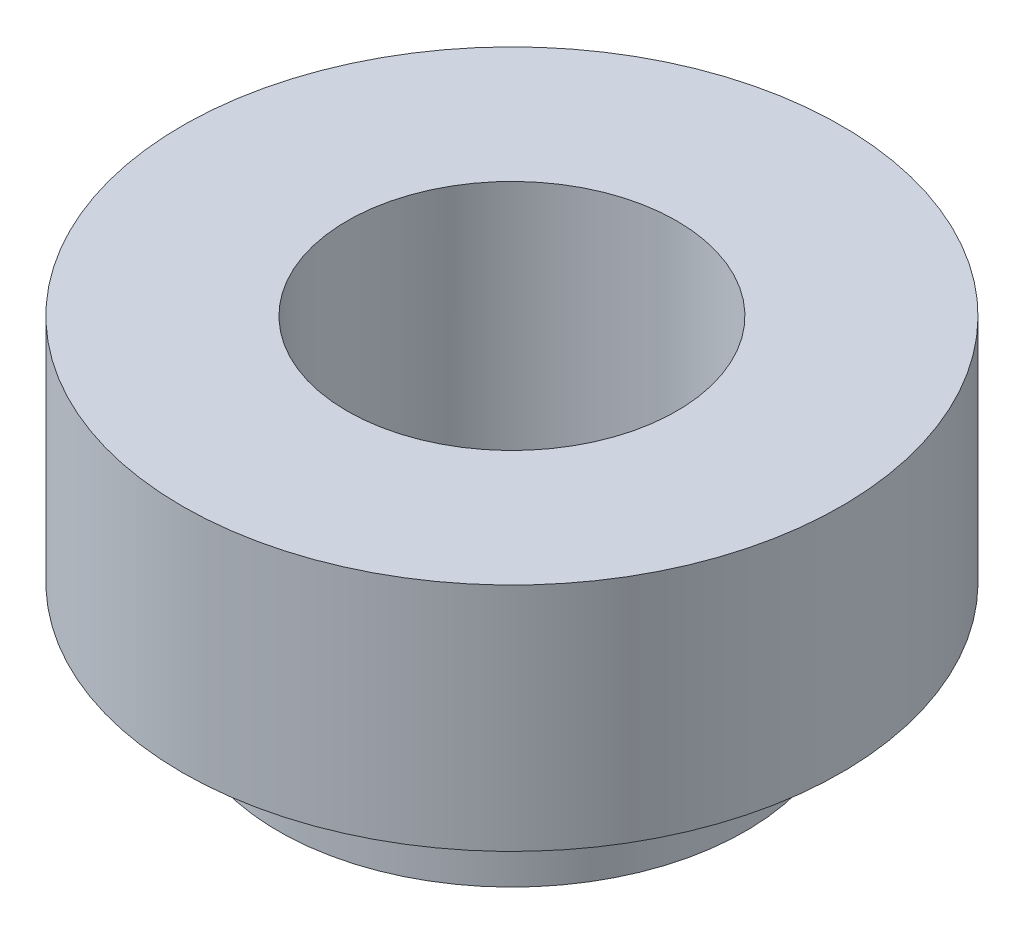
ISO-10303-21;
HEADER;
FILE_DESCRIPTION(('STEP AP214'),'2;1');
FILE_NAME('part.step','',(''),(''),'','','');
FILE_SCHEMA(('AUTOMOTIVE_DESIGN { 1 0 10303 214 1 1 1 1 }'));
ENDSEC;
DATA;
#1=APPLICATION_CONTEXT('core data for automotive mechanical design processes');
#2=APPLICATION_PROTOCOL_DEFINITION('international standard','automotive_design',2000,#1);
#3=PRODUCT_CONTEXT('',#1,'mechanical');
#4=PRODUCT('Part','Part','',(#3));
#5=PRODUCT_RELATED_PRODUCT_CATEGORY('part','',(#4));
#6=PRODUCT_DEFINITION_FORMATION('','',#4);
#7=PRODUCT_DEFINITION_CONTEXT('part definition',#1,'design');
#8=PRODUCT_DEFINITION('design','',#6,#7);
#9=PRODUCT_DEFINITION_SHAPE('','',#8);
#10=(LENGTH_UNIT() NAMED_UNIT(*) SI_UNIT(.MILLI.,.METRE.));
#11=(NAMED_UNIT(*) PLANE_ANGLE_UNIT() SI_UNIT($,.RADIAN.));
#12=(NAMED_UNIT(*) SI_UNIT($,.STERADIAN.) SOLID_ANGLE_UNIT());
#13=UNCERTAINTY_MEASURE_WITH_UNIT(LENGTH_MEASURE(1.E-05),#10,'distance_accuracy_value','');
#14=(GEOMETRIC_REPRESENTATION_CONTEXT(3) GLOBAL_UNCERTAINTY_ASSIGNED_CONTEXT((#13)) GLOBAL_UNIT_ASSIGNED_CONTEXT((#10,
#11,#12)) REPRESENTATION_CONTEXT('',''));
#15=CARTESIAN_POINT('',(0.,0.,0.));
#16=DIRECTION('',(0.,0.,1.));
#17=DIRECTION('',(1.,0.,0.));
#18=AXIS2_PLACEMENT_3D('',#15,#16,#17);
#19=CARTESIAN_POINT('',(0.,2.1,0.));
#20=DIRECTION('',(0.,-1.,0.));
#21=DIRECTION('',(0.,0.,-1.));
#22=AXIS2_PLACEMENT_3D('',#19,#20,#21);
#23=CYLINDRICAL_SURFACE('',#22,3.);
#24=CARTESIAN_POINT('',(0.,2.1,0.));
#25=DIRECTION('',(0.,1.,0.));
#26=DIRECTION('',(0.,0.,1.));
#27=AXIS2_PLACEMENT_3D('',#24,#25,#26);
#28=CIRCLE('',#27,3.);
#29=CARTESIAN_POINT('',(0.,2.1,3.));
#30=VERTEX_POINT('',#29);
#31=EDGE_CURVE('E46',#30,#30,#28,.T.);
#32=ORIENTED_EDGE('',*,*,#31,.F.);
#33=EDGE_LOOP('',(#32));
#34=FACE_BOUND('',#33,.T.);
#35=CARTESIAN_POINT('',(0.,0.,0.));
#36=DIRECTION('',(0.,1.,0.));
#37=DIRECTION('',(0.,0.,1.));
#38=AXIS2_PLACEMENT_3D('',#35,#36,#37);
#39=CIRCLE('',#38,3.);
#40=CARTESIAN_POINT('',(0.,0.,3.));
#41=VERTEX_POINT('',#40);
#42=EDGE_CURVE('E42',#41,#41,#39,.T.);
#43=ORIENTED_EDGE('',*,*,#42,.T.);
#44=EDGE_LOOP('',(#43));
#45=FACE_BOUND('',#44,.T.);
#46=ADVANCED_FACE('F39',(#34,#45),#23,.T.);
#47=CARTESIAN_POINT('',(0.,2.1,0.));
#48=DIRECTION('',(0.,1.,0.));
#49=DIRECTION('',(0.,0.,1.));
#50=AXIS2_PLACEMENT_3D('',#47,#48,#49);
#51=PLANE('',#50);
#52=CARTESIAN_POINT('',(0.,2.1,0.));
#53=DIRECTION('',(0.,1.,0.));
#54=DIRECTION('',(0.,0.,1.));
#55=AXIS2_PLACEMENT_3D('',#52,#53,#54);
#56=CIRCLE('',#55,1.5);
#57=CARTESIAN_POINT('',(0.,2.1,1.5));
#58=VERTEX_POINT('',#57);
#59=EDGE_CURVE('E55',#58,#58,#56,.T.);
#60=ORIENTED_EDGE('',*,*,#59,.F.);
#61=EDGE_LOOP('',(#60));
#62=FACE_BOUND('',#61,.T.);
#63=ORIENTED_EDGE('',*,*,#31,.T.);
#64=EDGE_LOOP('',(#63));
#65=FACE_BOUND('',#64,.T.);
#66=ADVANCED_FACE('F78',(#62,#65),#51,.T.);
#67=CARTESIAN_POINT('',(0.,0.,0.));
#68=DIRECTION('',(0.,1.,0.));
#69=DIRECTION('',(0.,0.,1.));
#70=AXIS2_PLACEMENT_3D('',#67,#68,#69);
#71=PLANE('',#70);
#72=CARTESIAN_POINT('',(0.,0.,0.));
#73=DIRECTION('',(0.,-1.,0.));
#74=DIRECTION('',(0.,0.,-1.));
#75=AXIS2_PLACEMENT_3D('',#72,#73,#74);
#76=CIRCLE('',#75,2.125);
#77=CARTESIAN_POINT('',(0.,0.,-2.125));
#78=VERTEX_POINT('',#77);
#79=EDGE_CURVE('E10',#78,#78,#76,.T.);
#80=ORIENTED_EDGE('',*,*,#79,.F.);
#81=EDGE_LOOP('',(#80));
#82=FACE_BOUND('',#81,.T.);
#83=ORIENTED_EDGE('',*,*,#42,.F.);
#84=EDGE_LOOP('',(#83));
#85=FACE_BOUND('',#84,.T.);
#86=ADVANCED_FACE('F72',(#82,#85),#71,.F.);
#87=CARTESIAN_POINT('',(0.,-0.9,0.));
#88=DIRECTION('',(0.,1.,0.));
#89=DIRECTION('',(0.,0.,1.));
#90=AXIS2_PLACEMENT_3D('',#87,#88,#89);
#91=CYLINDRICAL_SURFACE('',#90,2.125);
#92=CARTESIAN_POINT('',(0.,-0.9,0.));
#93=DIRECTION('',(0.,-1.,0.));
#94=DIRECTION('',(0.,0.,-1.));
#95=AXIS2_PLACEMENT_3D('',#92,#93,#94);
#96=CIRCLE('',#95,2.125);
#97=CARTESIAN_POINT('',(0.,-0.9,-2.125));
#98=VERTEX_POINT('',#97);
#99=EDGE_CURVE('E52',#98,#98,#96,.T.);
#100=ORIENTED_EDGE('',*,*,#99,.F.);
#101=EDGE_LOOP('',(#100));
#102=FACE_BOUND('',#101,.T.);
#103=ORIENTED_EDGE('',*,*,#79,.T.);
#104=EDGE_LOOP('',(#103));
#105=FACE_BOUND('',#104,.T.);
#106=ADVANCED_FACE('F67',(#102,#105),#91,.T.);
#107=CARTESIAN_POINT('',(0.,-0.9,0.));
#108=DIRECTION('',(0.,-1.,0.));
#109=DIRECTION('',(0.,0.,-1.));
#110=AXIS2_PLACEMENT_3D('',#107,#108,#109);
#111=PLANE('',#110);
#112=CARTESIAN_POINT('',(0.,-0.9,0.));
#113=DIRECTION('',(0.,-1.,0.));
#114=DIRECTION('',(0.,0.,-1.));
#115=AXIS2_PLACEMENT_3D('',#112,#113,#114);
#116=CIRCLE('',#115,1.5);
#117=CARTESIAN_POINT('',(0.,-0.9,-1.5));
#118=VERTEX_POINT('',#117);
#119=EDGE_CURVE('E58',#118,#118,#116,.T.);
#120=ORIENTED_EDGE('',*,*,#119,.F.);
#121=EDGE_LOOP('',(#120));
#122=FACE_BOUND('',#121,.T.);
#123=ORIENTED_EDGE('',*,*,#99,.T.);
#124=EDGE_LOOP('',(#123));
#125=FACE_BOUND('',#124,.T.);
#126=ADVANCED_FACE('F64',(#122,#125),#111,.T.);
#127=CARTESIAN_POINT('',(0.,2.4,0.));
#128=DIRECTION('',(0.,-1.,0.));
#129=DIRECTION('',(0.,0.,-1.));
#130=AXIS2_PLACEMENT_3D('',#127,#128,#129);
#131=CYLINDRICAL_SURFACE('',#130,1.5);
#132=ORIENTED_EDGE('',*,*,#59,.T.);
#133=EDGE_LOOP('',(#132));
#134=FACE_BOUND('',#133,.T.);
#135=ORIENTED_EDGE('',*,*,#119,.T.);
#136=EDGE_LOOP('',(#135));
#137=FACE_BOUND('',#136,.T.);
#138=ADVANCED_FACE('F62',(#134,#137),#131,.F.);
#139=CLOSED_SHELL('',(#46,#66,#86,#106,#126,#138));
#140=MANIFOLD_SOLID_BREP('B2',#139);
#141=ADVANCED_BREP_SHAPE_REPRESENTATION('',(#18,#140),#14);
#142=SHAPE_DEFINITION_REPRESENTATION(#9,#141);
ENDSEC;
END-ISO-10303-21;
